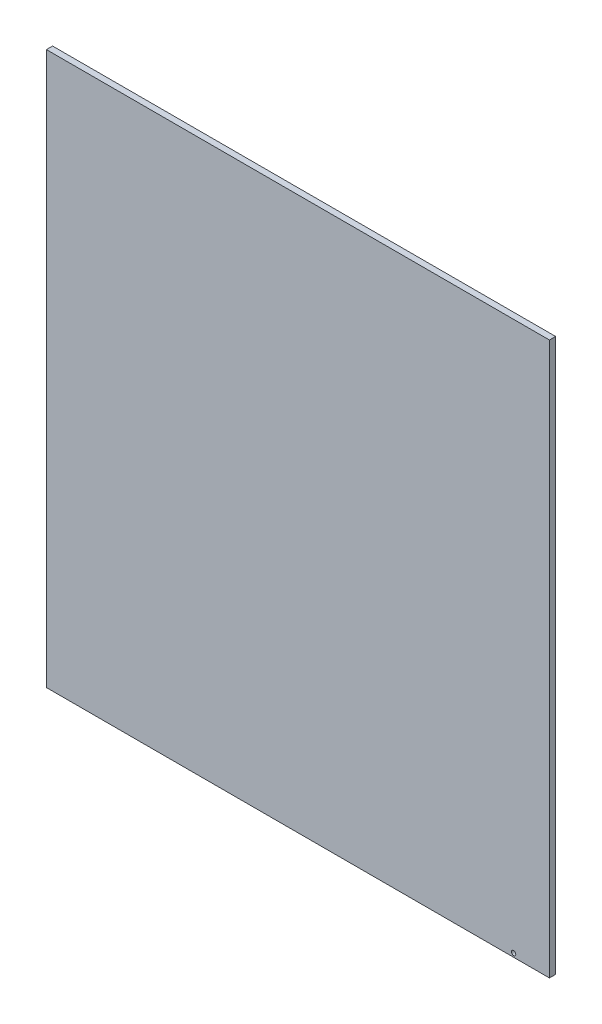
ISO-10303-21;
HEADER;
FILE_DESCRIPTION(('STEP AP214'),'2;1');
FILE_NAME('part.step','',(''),(''),'','','');
FILE_SCHEMA(('AUTOMOTIVE_DESIGN { 1 0 10303 214 1 1 1 1 }'));
ENDSEC;
DATA;
#1=APPLICATION_CONTEXT('core data for automotive mechanical design processes');
#2=APPLICATION_PROTOCOL_DEFINITION('international standard','automotive_design',2000,#1);
#3=PRODUCT_CONTEXT('',#1,'mechanical');
#4=PRODUCT('Part','Part','',(#3));
#5=PRODUCT_RELATED_PRODUCT_CATEGORY('part','',(#4));
#6=PRODUCT_DEFINITION_FORMATION('','',#4);
#7=PRODUCT_DEFINITION_CONTEXT('part definition',#1,'design');
#8=PRODUCT_DEFINITION('design','',#6,#7);
#9=PRODUCT_DEFINITION_SHAPE('','',#8);
#10=(LENGTH_UNIT() NAMED_UNIT(*) SI_UNIT(.MILLI.,.METRE.));
#11=(NAMED_UNIT(*) PLANE_ANGLE_UNIT() SI_UNIT($,.RADIAN.));
#12=(NAMED_UNIT(*) SI_UNIT($,.STERADIAN.) SOLID_ANGLE_UNIT());
#13=UNCERTAINTY_MEASURE_WITH_UNIT(LENGTH_MEASURE(1.E-05),#10,'distance_accuracy_value','');
#14=(GEOMETRIC_REPRESENTATION_CONTEXT(3) GLOBAL_UNCERTAINTY_ASSIGNED_CONTEXT((#13)) GLOBAL_UNIT_ASSIGNED_CONTEXT((#10,
#11,#12)) REPRESENTATION_CONTEXT('',''));
#15=CARTESIAN_POINT('',(0.,0.,0.));
#16=DIRECTION('',(0.,0.,1.));
#17=DIRECTION('',(1.,0.,0.));
#18=AXIS2_PLACEMENT_3D('',#15,#16,#17);
#19=CARTESIAN_POINT('',(0.,0.,5.));
#20=DIRECTION('',(0.,1.,0.));
#21=DIRECTION('',(0.,0.,1.));
#22=AXIS2_PLACEMENT_3D('',#19,#20,#21);
#23=PLANE('',#22);
#24=DIRECTION('',(0.,0.,-1.));
#25=VECTOR('',#24,1.);
#26=CARTESIAN_POINT('',(0.119395268107947,0.,5.));
#27=LINE('',#26,#25);
#28=CARTESIAN_POINT('',(0.119395268107947,0.,5.));
#29=VERTEX_POINT('',#28);
#30=CARTESIAN_POINT('',(0.119395268107947,0.,0.));
#31=VERTEX_POINT('',#30);
#32=EDGE_CURVE('E55',#29,#31,#27,.T.);
#33=ORIENTED_EDGE('',*,*,#32,.F.);
#34=DIRECTION('',(1.,0.,0.));
#35=VECTOR('',#34,1.);
#36=CARTESIAN_POINT('',(0.,0.,5.));
#37=LINE('',#36,#35);
#38=CARTESIAN_POINT('',(0.,0.,5.));
#39=VERTEX_POINT('',#38);
#40=EDGE_CURVE('E101',#39,#29,#37,.T.);
#41=ORIENTED_EDGE('',*,*,#40,.F.);
#42=DIRECTION('',(0.,0.,-1.));
#43=VECTOR('',#42,1.);
#44=CARTESIAN_POINT('',(0.,0.,5.));
#45=LINE('',#44,#43);
#46=CARTESIAN_POINT('',(0.,0.,0.));
#47=VERTEX_POINT('',#46);
#48=EDGE_CURVE('E41',#39,#47,#45,.T.);
#49=ORIENTED_EDGE('',*,*,#48,.T.);
#50=DIRECTION('',(1.,0.,0.));
#51=VECTOR('',#50,1.);
#52=CARTESIAN_POINT('',(0.,0.,0.));
#53=LINE('',#52,#51);
#54=EDGE_CURVE('E106',#47,#31,#53,.T.);
#55=ORIENTED_EDGE('',*,*,#54,.T.);
#56=EDGE_LOOP('',(#33,#41,#49,#55));
#57=FACE_BOUND('',#56,.T.);
#58=ADVANCED_FACE('F33',(#57),#23,.F.);
#59=CARTESIAN_POINT('',(0.,0.,5.));
#60=DIRECTION('',(1.,0.,0.));
#61=DIRECTION('',(0.,0.,-1.));
#62=AXIS2_PLACEMENT_3D('',#59,#60,#61);
#63=PLANE('',#62);
#64=DIRECTION('',(0.,-1.,0.));
#65=VECTOR('',#64,1.);
#66=CARTESIAN_POINT('',(0.,0.,5.));
#67=LINE('',#66,#65);
#68=CARTESIAN_POINT('',(0.,443.,5.));
#69=VERTEX_POINT('',#68);
#70=EDGE_CURVE('E95',#69,#39,#67,.T.);
#71=ORIENTED_EDGE('',*,*,#70,.F.);
#72=DIRECTION('',(0.,0.,1.));
#73=VECTOR('',#72,1.);
#74=CARTESIAN_POINT('',(0.,443.,-5.));
#75=LINE('',#74,#73);
#76=CARTESIAN_POINT('',(0.,443.,0.));
#77=VERTEX_POINT('',#76);
#78=EDGE_CURVE('E84',#77,#69,#75,.T.);
#79=ORIENTED_EDGE('',*,*,#78,.F.);
#80=DIRECTION('',(0.,-1.,0.));
#81=VECTOR('',#80,1.);
#82=CARTESIAN_POINT('',(0.,0.,0.));
#83=LINE('',#82,#81);
#84=EDGE_CURVE('E112',#77,#47,#83,.T.);
#85=ORIENTED_EDGE('',*,*,#84,.T.);
#86=ORIENTED_EDGE('',*,*,#48,.F.);
#87=EDGE_LOOP('',(#71,#79,#85,#86));
#88=FACE_BOUND('',#87,.T.);
#89=ADVANCED_FACE('F35',(#88),#63,.F.);
#90=CARTESIAN_POINT('',(407.,0.,5.));
#91=DIRECTION('',(-1.,0.,0.));
#92=DIRECTION('',(0.,0.,1.));
#93=AXIS2_PLACEMENT_3D('',#90,#91,#92);
#94=PLANE('',#93);
#95=DIRECTION('',(0.,1.,0.));
#96=VECTOR('',#95,1.);
#97=CARTESIAN_POINT('',(407.,0.,0.));
#98=LINE('',#97,#96);
#99=CARTESIAN_POINT('',(407.,-4.00000000000005,0.));
#100=VERTEX_POINT('',#99);
#101=CARTESIAN_POINT('',(407.,443.,0.));
#102=VERTEX_POINT('',#101);
#103=EDGE_CURVE('E102',#100,#102,#98,.T.);
#104=ORIENTED_EDGE('',*,*,#103,.T.);
#105=DIRECTION('',(0.,0.,1.));
#106=VECTOR('',#105,1.);
#107=CARTESIAN_POINT('',(407.,443.,-5.));
#108=LINE('',#107,#106);
#109=CARTESIAN_POINT('',(407.,443.,5.));
#110=VERTEX_POINT('',#109);
#111=EDGE_CURVE('E47',#102,#110,#108,.T.);
#112=ORIENTED_EDGE('',*,*,#111,.T.);
#113=DIRECTION('',(0.,1.,0.));
#114=VECTOR('',#113,1.);
#115=CARTESIAN_POINT('',(407.,0.,5.));
#116=LINE('',#115,#114);
#117=CARTESIAN_POINT('',(407.,-4.00000000000005,5.));
#118=VERTEX_POINT('',#117);
#119=EDGE_CURVE('E97',#118,#110,#116,.T.);
#120=ORIENTED_EDGE('',*,*,#119,.F.);
#121=DIRECTION('',(0.,0.,-1.));
#122=VECTOR('',#121,1.);
#123=CARTESIAN_POINT('',(407.,-4.00000000000005,5.));
#124=LINE('',#123,#122);
#125=EDGE_CURVE('E137',#118,#100,#124,.T.);
#126=ORIENTED_EDGE('',*,*,#125,.T.);
#127=EDGE_LOOP('',(#104,#112,#120,#126));
#128=FACE_BOUND('',#127,.T.);
#129=ADVANCED_FACE('F142',(#128),#94,.F.);
#130=CARTESIAN_POINT('',(0.,0.,5.));
#131=DIRECTION('',(0.,0.,-1.));
#132=DIRECTION('',(-1.,0.,0.));
#133=AXIS2_PLACEMENT_3D('',#130,#131,#132);
#134=PLANE('',#133);
#135=CARTESIAN_POINT('',(378.,-1.00000000000005,5.));
#136=DIRECTION('',(0.,0.,-1.));
#137=DIRECTION('',(-1.,0.,0.));
#138=AXIS2_PLACEMENT_3D('',#135,#136,#137);
#139=CIRCLE('',#138,1.74999999999998);
#140=CARTESIAN_POINT('',(376.25,-1.00000000000005,5.));
#141=VERTEX_POINT('',#140);
#142=EDGE_CURVE('E135',#141,#141,#139,.T.);
#143=ORIENTED_EDGE('',*,*,#142,.T.);
#144=EDGE_LOOP('',(#143));
#145=FACE_BOUND('',#144,.T.);
#146=ORIENTED_EDGE('',*,*,#119,.T.);
#147=DIRECTION('',(1.,0.,0.));
#148=VECTOR('',#147,1.);
#149=CARTESIAN_POINT('',(0.,443.,5.));
#150=LINE('',#149,#148);
#151=EDGE_CURVE('E87',#69,#110,#150,.T.);
#152=ORIENTED_EDGE('',*,*,#151,.F.);
#153=ORIENTED_EDGE('',*,*,#70,.T.);
#154=ORIENTED_EDGE('',*,*,#40,.T.);
#155=DIRECTION('',(0.,1.,0.));
#156=VECTOR('',#155,1.);
#157=CARTESIAN_POINT('',(0.119395268107947,0.,5.));
#158=LINE('',#157,#156);
#159=CARTESIAN_POINT('',(0.119395268107946,-4.,5.));
#160=VERTEX_POINT('',#159);
#161=EDGE_CURVE('E118',#160,#29,#158,.T.);
#162=ORIENTED_EDGE('',*,*,#161,.F.);
#163=DIRECTION('',(-1.,0.,0.));
#164=VECTOR('',#163,1.);
#165=CARTESIAN_POINT('',(0.119395268107946,-4.,5.));
#166=LINE('',#165,#164);
#167=EDGE_CURVE('E124',#118,#160,#166,.T.);
#168=ORIENTED_EDGE('',*,*,#167,.F.);
#169=EDGE_LOOP('',(#146,#152,#153,#154,#162,#168));
#170=FACE_BOUND('',#169,.T.);
#171=ADVANCED_FACE('F94',(#145,#170),#134,.F.);
#172=CARTESIAN_POINT('',(0.,0.,0.));
#173=DIRECTION('',(0.,0.,-1.));
#174=DIRECTION('',(-1.,0.,0.));
#175=AXIS2_PLACEMENT_3D('',#172,#173,#174);
#176=PLANE('',#175);
#177=DIRECTION('',(-1.,0.,0.));
#178=VECTOR('',#177,1.);
#179=CARTESIAN_POINT('',(0.,443.,0.));
#180=LINE('',#179,#178);
#181=EDGE_CURVE('E11',#102,#77,#180,.T.);
#182=ORIENTED_EDGE('',*,*,#181,.F.);
#183=ORIENTED_EDGE('',*,*,#103,.F.);
#184=DIRECTION('',(-1.,0.,0.));
#185=VECTOR('',#184,1.);
#186=CARTESIAN_POINT('',(0.119395268107946,-4.,0.));
#187=LINE('',#186,#185);
#188=CARTESIAN_POINT('',(0.119395268107946,-4.,0.));
#189=VERTEX_POINT('',#188);
#190=EDGE_CURVE('E125',#100,#189,#187,.T.);
#191=ORIENTED_EDGE('',*,*,#190,.T.);
#192=DIRECTION('',(0.,1.,0.));
#193=VECTOR('',#192,1.);
#194=CARTESIAN_POINT('',(0.119395268107947,0.,0.));
#195=LINE('',#194,#193);
#196=EDGE_CURVE('E129',#189,#31,#195,.T.);
#197=ORIENTED_EDGE('',*,*,#196,.T.);
#198=ORIENTED_EDGE('',*,*,#54,.F.);
#199=ORIENTED_EDGE('',*,*,#84,.F.);
#200=EDGE_LOOP('',(#182,#183,#191,#197,#198,#199));
#201=FACE_BOUND('',#200,.T.);
#202=CARTESIAN_POINT('',(378.,-1.00000000000005,0.));
#203=DIRECTION('',(0.,0.,-1.));
#204=DIRECTION('',(-1.,0.,0.));
#205=AXIS2_PLACEMENT_3D('',#202,#203,#204);
#206=CIRCLE('',#205,1.74999999999998);
#207=CARTESIAN_POINT('',(376.25,-1.00000000000005,0.));
#208=VERTEX_POINT('',#207);
#209=EDGE_CURVE('E132',#208,#208,#206,.T.);
#210=ORIENTED_EDGE('',*,*,#209,.F.);
#211=EDGE_LOOP('',(#210));
#212=FACE_BOUND('',#211,.T.);
#213=ADVANCED_FACE('F146',(#201,#212),#176,.T.);
#214=CARTESIAN_POINT('',(0.119395268107947,0.,5.));
#215=DIRECTION('',(-1.,0.,0.));
#216=DIRECTION('',(0.,-1.,0.));
#217=AXIS2_PLACEMENT_3D('',#214,#215,#216);
#218=PLANE('',#217);
#219=ORIENTED_EDGE('',*,*,#196,.F.);
#220=DIRECTION('',(0.,0.,-1.));
#221=VECTOR('',#220,1.);
#222=CARTESIAN_POINT('',(0.119395268107946,-4.,5.));
#223=LINE('',#222,#221);
#224=EDGE_CURVE('E114',#160,#189,#223,.T.);
#225=ORIENTED_EDGE('',*,*,#224,.F.);
#226=ORIENTED_EDGE('',*,*,#161,.T.);
#227=ORIENTED_EDGE('',*,*,#32,.T.);
#228=EDGE_LOOP('',(#219,#225,#226,#227));
#229=FACE_BOUND('',#228,.T.);
#230=ADVANCED_FACE('F122',(#229),#218,.T.);
#231=CARTESIAN_POINT('',(0.119395268107946,-4.,5.));
#232=DIRECTION('',(0.,-1.,0.));
#233=DIRECTION('',(1.,0.,0.));
#234=AXIS2_PLACEMENT_3D('',#231,#232,#233);
#235=PLANE('',#234);
#236=ORIENTED_EDGE('',*,*,#190,.F.);
#237=ORIENTED_EDGE('',*,*,#125,.F.);
#238=ORIENTED_EDGE('',*,*,#167,.T.);
#239=ORIENTED_EDGE('',*,*,#224,.T.);
#240=EDGE_LOOP('',(#236,#237,#238,#239));
#241=FACE_BOUND('',#240,.T.);
#242=ADVANCED_FACE('F144',(#241),#235,.T.);
#243=CARTESIAN_POINT('',(378.,-1.00000000000005,5.));
#244=DIRECTION('',(0.,0.,-1.));
#245=DIRECTION('',(-1.,0.,0.));
#246=AXIS2_PLACEMENT_3D('',#243,#244,#245);
#247=CYLINDRICAL_SURFACE('',#246,1.74999999999998);
#248=ORIENTED_EDGE('',*,*,#142,.F.);
#249=EDGE_LOOP('',(#248));
#250=FACE_BOUND('',#249,.T.);
#251=ORIENTED_EDGE('',*,*,#209,.T.);
#252=EDGE_LOOP('',(#251));
#253=FACE_BOUND('',#252,.T.);
#254=ADVANCED_FACE('F158',(#250,#253),#247,.F.);
#255=CARTESIAN_POINT('',(0.,443.,-5.));
#256=DIRECTION('',(0.,-1.,0.));
#257=DIRECTION('',(0.,0.,-1.));
#258=AXIS2_PLACEMENT_3D('',#255,#256,#257);
#259=PLANE('',#258);
#260=ORIENTED_EDGE('',*,*,#181,.T.);
#261=ORIENTED_EDGE('',*,*,#78,.T.);
#262=ORIENTED_EDGE('',*,*,#151,.T.);
#263=ORIENTED_EDGE('',*,*,#111,.F.);
#264=EDGE_LOOP('',(#260,#261,#262,#263));
#265=FACE_BOUND('',#264,.T.);
#266=ADVANCED_FACE('F86',(#265),#259,.F.);
#267=CLOSED_SHELL('',(#58,#89,#129,#171,#213,#230,#242,#254,#266));
#268=MANIFOLD_SOLID_BREP('B2',#267);
#269=ADVANCED_BREP_SHAPE_REPRESENTATION('',(#18,#268),#14);
#270=SHAPE_DEFINITION_REPRESENTATION(#9,#269);
ENDSEC;
END-ISO-10303-21;
